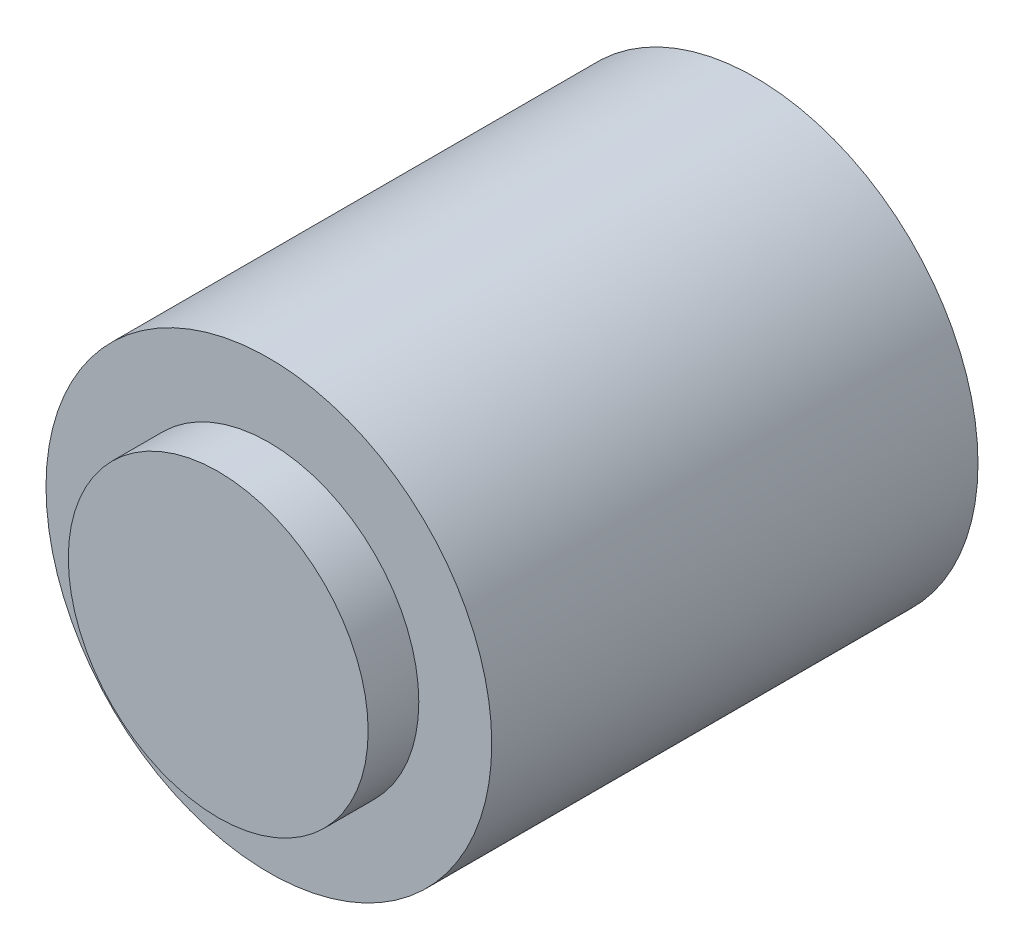
ISO-10303-21;
HEADER;
FILE_DESCRIPTION(('STEP AP214'),'2;1');
FILE_NAME('part.step','',(''),(''),'','','');
FILE_SCHEMA(('AUTOMOTIVE_DESIGN { 1 0 10303 214 1 1 1 1 }'));
ENDSEC;
DATA;
#1=APPLICATION_CONTEXT('core data for automotive mechanical design processes');
#2=APPLICATION_PROTOCOL_DEFINITION('international standard','automotive_design',2000,#1);
#3=PRODUCT_CONTEXT('',#1,'mechanical');
#4=PRODUCT('Part','Part','',(#3));
#5=PRODUCT_RELATED_PRODUCT_CATEGORY('part','',(#4));
#6=PRODUCT_DEFINITION_FORMATION('','',#4);
#7=PRODUCT_DEFINITION_CONTEXT('part definition',#1,'design');
#8=PRODUCT_DEFINITION('design','',#6,#7);
#9=PRODUCT_DEFINITION_SHAPE('','',#8);
#10=(LENGTH_UNIT() NAMED_UNIT(*) SI_UNIT(.MILLI.,.METRE.));
#11=(NAMED_UNIT(*) PLANE_ANGLE_UNIT() SI_UNIT($,.RADIAN.));
#12=(NAMED_UNIT(*) SI_UNIT($,.STERADIAN.) SOLID_ANGLE_UNIT());
#13=UNCERTAINTY_MEASURE_WITH_UNIT(LENGTH_MEASURE(1.E-05),#10,'distance_accuracy_value','');
#14=(GEOMETRIC_REPRESENTATION_CONTEXT(3) GLOBAL_UNCERTAINTY_ASSIGNED_CONTEXT((#13)) GLOBAL_UNIT_ASSIGNED_CONTEXT((#10,
#11,#12)) REPRESENTATION_CONTEXT('',''));
#15=CARTESIAN_POINT('',(0.,0.,0.));
#16=DIRECTION('',(0.,0.,1.));
#17=DIRECTION('',(1.,0.,0.));
#18=AXIS2_PLACEMENT_3D('',#15,#16,#17);
#19=CARTESIAN_POINT('',(0.,0.,-1.3));
#20=DIRECTION('',(0.,0.,-1.));
#21=DIRECTION('',(-1.,0.,0.));
#22=AXIS2_PLACEMENT_3D('',#19,#20,#21);
#23=PLANE('',#22);
#24=CARTESIAN_POINT('',(0.,0.,-1.3));
#25=DIRECTION('',(0.,0.,-1.));
#26=DIRECTION('',(-1.,0.,0.));
#27=AXIS2_PLACEMENT_3D('',#24,#25,#26);
#28=CIRCLE('',#27,3.65);
#29=CARTESIAN_POINT('',(-3.65,0.,-1.3));
#30=VERTEX_POINT('',#29);
#31=EDGE_CURVE('E50',#30,#30,#28,.T.);
#32=ORIENTED_EDGE('',*,*,#31,.T.);
#33=EDGE_LOOP('',(#32));
#34=FACE_BOUND('',#33,.T.);
#35=CARTESIAN_POINT('',(0.,0.,-1.3));
#36=DIRECTION('',(0.,0.,-1.));
#37=DIRECTION('',(-1.,0.,0.));
#38=AXIS2_PLACEMENT_3D('',#35,#36,#37);
#39=CIRCLE('',#38,1.5);
#40=CARTESIAN_POINT('',(-1.5,0.,-1.3));
#41=VERTEX_POINT('',#40);
#42=EDGE_CURVE('E56',#41,#41,#39,.T.);
#43=ORIENTED_EDGE('',*,*,#42,.F.);
#44=EDGE_LOOP('',(#43));
#45=FACE_BOUND('',#44,.T.);
#46=ADVANCED_FACE('F29',(#34,#45),#23,.T.);
#47=CARTESIAN_POINT('',(0.,0.,0.));
#48=DIRECTION('',(0.,0.,1.));
#49=DIRECTION('',(1.,0.,0.));
#50=AXIS2_PLACEMENT_3D('',#47,#48,#49);
#51=PLANE('',#50);
#52=CARTESIAN_POINT('',(0.,0.,0.));
#53=DIRECTION('',(0.,0.,1.));
#54=DIRECTION('',(1.,0.,0.));
#55=AXIS2_PLACEMENT_3D('',#52,#53,#54);
#56=CIRCLE('',#55,11.);
#57=CARTESIAN_POINT('',(11.,0.,0.));
#58=VERTEX_POINT('',#57);
#59=EDGE_CURVE('E40',#58,#58,#56,.T.);
#60=ORIENTED_EDGE('',*,*,#59,.F.);
#61=EDGE_LOOP('',(#60));
#62=FACE_BOUND('',#61,.T.);
#63=CARTESIAN_POINT('',(0.,0.,0.));
#64=DIRECTION('',(0.,0.,1.));
#65=DIRECTION('',(1.,0.,0.));
#66=AXIS2_PLACEMENT_3D('',#63,#64,#65);
#67=CIRCLE('',#66,3.65);
#68=CARTESIAN_POINT('',(3.65,0.,0.));
#69=VERTEX_POINT('',#68);
#70=EDGE_CURVE('E10',#69,#69,#67,.F.);
#71=ORIENTED_EDGE('',*,*,#70,.F.);
#72=EDGE_LOOP('',(#71));
#73=FACE_BOUND('',#72,.T.);
#74=ADVANCED_FACE('F72',(#62,#73),#51,.F.);
#75=CARTESIAN_POINT('',(0.,0.,24.));
#76=DIRECTION('',(0.,0.,1.));
#77=DIRECTION('',(1.,0.,0.));
#78=AXIS2_PLACEMENT_3D('',#75,#76,#77);
#79=PLANE('',#78);
#80=CARTESIAN_POINT('',(0.,0.,24.));
#81=DIRECTION('',(0.,0.,1.));
#82=DIRECTION('',(1.,0.,0.));
#83=AXIS2_PLACEMENT_3D('',#80,#81,#82);
#84=CIRCLE('',#83,11.);
#85=CARTESIAN_POINT('',(11.,0.,24.));
#86=VERTEX_POINT('',#85);
#87=EDGE_CURVE('E36',#86,#86,#84,.T.);
#88=ORIENTED_EDGE('',*,*,#87,.T.);
#89=EDGE_LOOP('',(#88));
#90=FACE_BOUND('',#89,.T.);
#91=CARTESIAN_POINT('',(0.,0.,24.));
#92=DIRECTION('',(0.,0.,1.));
#93=DIRECTION('',(1.,0.,0.));
#94=AXIS2_PLACEMENT_3D('',#91,#92,#93);
#95=CIRCLE('',#94,7.4);
#96=CARTESIAN_POINT('',(7.4,0.,24.));
#97=VERTEX_POINT('',#96);
#98=EDGE_CURVE('E47',#97,#97,#95,.T.);
#99=ORIENTED_EDGE('',*,*,#98,.F.);
#100=EDGE_LOOP('',(#99));
#101=FACE_BOUND('',#100,.T.);
#102=ADVANCED_FACE('F78',(#90,#101),#79,.T.);
#103=CARTESIAN_POINT('',(0.,0.,24.));
#104=DIRECTION('',(0.,0.,-1.));
#105=DIRECTION('',(-1.,0.,0.));
#106=AXIS2_PLACEMENT_3D('',#103,#104,#105);
#107=CYLINDRICAL_SURFACE('',#106,11.);
#108=ORIENTED_EDGE('',*,*,#87,.F.);
#109=EDGE_LOOP('',(#108));
#110=FACE_BOUND('',#109,.T.);
#111=ORIENTED_EDGE('',*,*,#59,.T.);
#112=EDGE_LOOP('',(#111));
#113=FACE_BOUND('',#112,.T.);
#114=ADVANCED_FACE('F31',(#110,#113),#107,.T.);
#115=CARTESIAN_POINT('',(0.,0.,26.5));
#116=DIRECTION('',(0.,0.,-1.));
#117=DIRECTION('',(-1.,0.,0.));
#118=AXIS2_PLACEMENT_3D('',#115,#116,#117);
#119=CYLINDRICAL_SURFACE('',#118,7.4);
#120=CARTESIAN_POINT('',(0.,0.,26.5));
#121=DIRECTION('',(0.,0.,1.));
#122=DIRECTION('',(1.,0.,0.));
#123=AXIS2_PLACEMENT_3D('',#120,#121,#122);
#124=CIRCLE('',#123,7.4);
#125=CARTESIAN_POINT('',(7.4,0.,26.5));
#126=VERTEX_POINT('',#125);
#127=EDGE_CURVE('E45',#126,#126,#124,.T.);
#128=ORIENTED_EDGE('',*,*,#127,.F.);
#129=EDGE_LOOP('',(#128));
#130=FACE_BOUND('',#129,.T.);
#131=ORIENTED_EDGE('',*,*,#98,.T.);
#132=EDGE_LOOP('',(#131));
#133=FACE_BOUND('',#132,.T.);
#134=ADVANCED_FACE('F88',(#130,#133),#119,.T.);
#135=CARTESIAN_POINT('',(0.,0.,26.5));
#136=DIRECTION('',(0.,0.,1.));
#137=DIRECTION('',(1.,0.,0.));
#138=AXIS2_PLACEMENT_3D('',#135,#136,#137);
#139=PLANE('',#138);
#140=ORIENTED_EDGE('',*,*,#127,.T.);
#141=EDGE_LOOP('',(#140));
#142=FACE_BOUND('',#141,.T.);
#143=ADVANCED_FACE('F84',(#142),#139,.T.);
#144=CARTESIAN_POINT('',(0.,0.,-1.3));
#145=DIRECTION('',(0.,0.,1.));
#146=DIRECTION('',(1.,0.,0.));
#147=AXIS2_PLACEMENT_3D('',#144,#145,#146);
#148=CYLINDRICAL_SURFACE('',#147,3.65);
#149=ORIENTED_EDGE('',*,*,#31,.F.);
#150=EDGE_LOOP('',(#149));
#151=FACE_BOUND('',#150,.T.);
#152=ORIENTED_EDGE('',*,*,#70,.T.);
#153=EDGE_LOOP('',(#152));
#154=FACE_BOUND('',#153,.T.);
#155=ADVANCED_FACE('F67',(#151,#154),#148,.T.);
#156=CARTESIAN_POINT('',(0.,0.,-6.3));
#157=DIRECTION('',(0.,0.,1.));
#158=DIRECTION('',(1.,0.,0.));
#159=AXIS2_PLACEMENT_3D('',#156,#157,#158);
#160=CYLINDRICAL_SURFACE('',#159,1.5);
#161=CARTESIAN_POINT('',(0.,0.,-6.3));
#162=DIRECTION('',(0.,0.,-1.));
#163=DIRECTION('',(-1.,0.,0.));
#164=AXIS2_PLACEMENT_3D('',#161,#162,#163);
#165=CIRCLE('',#164,1.5);
#166=CARTESIAN_POINT('',(-1.5,0.,-6.3));
#167=VERTEX_POINT('',#166);
#168=EDGE_CURVE('E55',#167,#167,#165,.T.);
#169=ORIENTED_EDGE('',*,*,#168,.F.);
#170=EDGE_LOOP('',(#169));
#171=FACE_BOUND('',#170,.T.);
#172=ORIENTED_EDGE('',*,*,#42,.T.);
#173=EDGE_LOOP('',(#172));
#174=FACE_BOUND('',#173,.T.);
#175=ADVANCED_FACE('F64',(#171,#174),#160,.T.);
#176=CARTESIAN_POINT('',(0.,0.,-6.3));
#177=DIRECTION('',(0.,0.,-1.));
#178=DIRECTION('',(-1.,0.,0.));
#179=AXIS2_PLACEMENT_3D('',#176,#177,#178);
#180=PLANE('',#179);
#181=ORIENTED_EDGE('',*,*,#168,.T.);
#182=EDGE_LOOP('',(#181));
#183=FACE_BOUND('',#182,.T.);
#184=ADVANCED_FACE('F62',(#183),#180,.T.);
#185=CLOSED_SHELL('',(#46,#74,#102,#114,#134,#143,#155,#175,#184));
#186=MANIFOLD_SOLID_BREP('B2',#185);
#187=ADVANCED_BREP_SHAPE_REPRESENTATION('',(#18,#186),#14);
#188=SHAPE_DEFINITION_REPRESENTATION(#9,#187);
ENDSEC;
END-ISO-10303-21;
